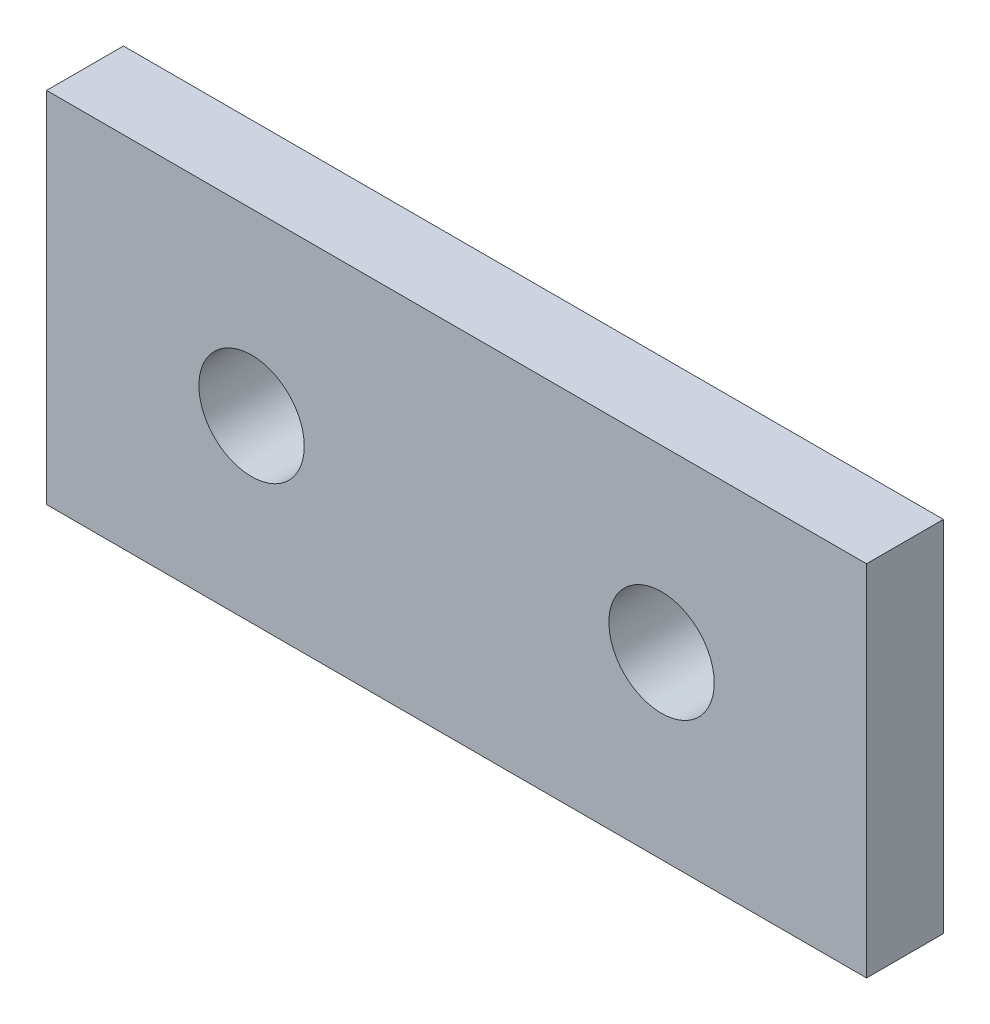
ISO-10303-21;
HEADER;
FILE_DESCRIPTION(('STEP AP214'),'2;1');
FILE_NAME('part.step','',(''),(''),'','','');
FILE_SCHEMA(('AUTOMOTIVE_DESIGN { 1 0 10303 214 1 1 1 1 }'));
ENDSEC;
DATA;
#1=APPLICATION_CONTEXT('core data for automotive mechanical design processes');
#2=APPLICATION_PROTOCOL_DEFINITION('international standard','automotive_design',2000,#1);
#3=PRODUCT_CONTEXT('',#1,'mechanical');
#4=PRODUCT('Part','Part','',(#3));
#5=PRODUCT_RELATED_PRODUCT_CATEGORY('part','',(#4));
#6=PRODUCT_DEFINITION_FORMATION('','',#4);
#7=PRODUCT_DEFINITION_CONTEXT('part definition',#1,'design');
#8=PRODUCT_DEFINITION('design','',#6,#7);
#9=PRODUCT_DEFINITION_SHAPE('','',#8);
#10=(LENGTH_UNIT() NAMED_UNIT(*) SI_UNIT(.MILLI.,.METRE.));
#11=(NAMED_UNIT(*) PLANE_ANGLE_UNIT() SI_UNIT($,.RADIAN.));
#12=(NAMED_UNIT(*) SI_UNIT($,.STERADIAN.) SOLID_ANGLE_UNIT());
#13=UNCERTAINTY_MEASURE_WITH_UNIT(LENGTH_MEASURE(1.E-05),#10,'distance_accuracy_value','');
#14=(GEOMETRIC_REPRESENTATION_CONTEXT(3) GLOBAL_UNCERTAINTY_ASSIGNED_CONTEXT((#13)) GLOBAL_UNIT_ASSIGNED_CONTEXT((#10,
#11,#12)) REPRESENTATION_CONTEXT('',''));
#15=CARTESIAN_POINT('',(0.,0.,0.));
#16=DIRECTION('',(0.,0.,1.));
#17=DIRECTION('',(1.,0.,0.));
#18=AXIS2_PLACEMENT_3D('',#15,#16,#17);
#19=CARTESIAN_POINT('',(-25.4,11.1125,-4.7625));
#20=DIRECTION('',(-1.,0.,0.));
#21=DIRECTION('',(0.,0.,1.));
#22=AXIS2_PLACEMENT_3D('',#19,#20,#21);
#23=PLANE('',#22);
#24=DIRECTION('',(0.,-1.,0.));
#25=VECTOR('',#24,1.);
#26=CARTESIAN_POINT('',(-25.4,11.1125,0.));
#27=LINE('',#26,#25);
#28=CARTESIAN_POINT('',(-25.4,11.1125,0.));
#29=VERTEX_POINT('',#28);
#30=CARTESIAN_POINT('',(-25.4,-11.1125,0.));
#31=VERTEX_POINT('',#30);
#32=EDGE_CURVE('E96',#29,#31,#27,.T.);
#33=ORIENTED_EDGE('',*,*,#32,.F.);
#34=DIRECTION('',(0.,0.,1.));
#35=VECTOR('',#34,1.);
#36=CARTESIAN_POINT('',(-25.4,11.1125,-4.7625));
#37=LINE('',#36,#35);
#38=CARTESIAN_POINT('',(-25.4,11.1125,-4.7625));
#39=VERTEX_POINT('',#38);
#40=EDGE_CURVE('E11',#39,#29,#37,.T.);
#41=ORIENTED_EDGE('',*,*,#40,.F.);
#42=DIRECTION('',(0.,-1.,0.));
#43=VECTOR('',#42,1.);
#44=CARTESIAN_POINT('',(-25.4,11.1125,-4.7625));
#45=LINE('',#44,#43);
#46=CARTESIAN_POINT('',(-25.4,-11.1125,-4.7625));
#47=VERTEX_POINT('',#46);
#48=EDGE_CURVE('E89',#39,#47,#45,.T.);
#49=ORIENTED_EDGE('',*,*,#48,.T.);
#50=DIRECTION('',(0.,0.,1.));
#51=VECTOR('',#50,1.);
#52=CARTESIAN_POINT('',(-25.4,-11.1125,-4.7625));
#53=LINE('',#52,#51);
#54=EDGE_CURVE('E34',#47,#31,#53,.T.);
#55=ORIENTED_EDGE('',*,*,#54,.T.);
#56=EDGE_LOOP('',(#33,#41,#49,#55));
#57=FACE_BOUND('',#56,.T.);
#58=ADVANCED_FACE('F31',(#57),#23,.T.);
#59=CARTESIAN_POINT('',(-25.4,11.1125,-4.7625));
#60=DIRECTION('',(0.,1.,0.));
#61=DIRECTION('',(-1.,0.,0.));
#62=AXIS2_PLACEMENT_3D('',#59,#60,#61);
#63=PLANE('',#62);
#64=DIRECTION('',(-1.,0.,0.));
#65=VECTOR('',#64,1.);
#66=CARTESIAN_POINT('',(-25.4,11.1125,0.));
#67=LINE('',#66,#65);
#68=CARTESIAN_POINT('',(25.4,11.1125,0.));
#69=VERTEX_POINT('',#68);
#70=EDGE_CURVE('E91',#69,#29,#67,.T.);
#71=ORIENTED_EDGE('',*,*,#70,.F.);
#72=DIRECTION('',(0.,0.,1.));
#73=VECTOR('',#72,1.);
#74=CARTESIAN_POINT('',(25.4,11.1125,-4.7625));
#75=LINE('',#74,#73);
#76=CARTESIAN_POINT('',(25.4,11.1125,-4.7625));
#77=VERTEX_POINT('',#76);
#78=EDGE_CURVE('E40',#77,#69,#75,.T.);
#79=ORIENTED_EDGE('',*,*,#78,.F.);
#80=DIRECTION('',(-1.,0.,0.));
#81=VECTOR('',#80,1.);
#82=CARTESIAN_POINT('',(-25.4,11.1125,-4.7625));
#83=LINE('',#82,#81);
#84=EDGE_CURVE('E86',#77,#39,#83,.T.);
#85=ORIENTED_EDGE('',*,*,#84,.T.);
#86=ORIENTED_EDGE('',*,*,#40,.T.);
#87=EDGE_LOOP('',(#71,#79,#85,#86));
#88=FACE_BOUND('',#87,.T.);
#89=ADVANCED_FACE('F107',(#88),#63,.T.);
#90=CARTESIAN_POINT('',(25.4,11.1125,-4.7625));
#91=DIRECTION('',(1.,0.,0.));
#92=DIRECTION('',(0.,0.,-1.));
#93=AXIS2_PLACEMENT_3D('',#90,#91,#92);
#94=PLANE('',#93);
#95=DIRECTION('',(0.,1.,0.));
#96=VECTOR('',#95,1.);
#97=CARTESIAN_POINT('',(25.4,11.1125,0.));
#98=LINE('',#97,#96);
#99=CARTESIAN_POINT('',(25.4,-11.1125,0.));
#100=VERTEX_POINT('',#99);
#101=EDGE_CURVE('E81',#100,#69,#98,.T.);
#102=ORIENTED_EDGE('',*,*,#101,.F.);
#103=DIRECTION('',(0.,0.,1.));
#104=VECTOR('',#103,1.);
#105=CARTESIAN_POINT('',(25.4,-11.1125,-4.7625));
#106=LINE('',#105,#104);
#107=CARTESIAN_POINT('',(25.4,-11.1125,-4.7625));
#108=VERTEX_POINT('',#107);
#109=EDGE_CURVE('E76',#108,#100,#106,.T.);
#110=ORIENTED_EDGE('',*,*,#109,.F.);
#111=DIRECTION('',(0.,1.,0.));
#112=VECTOR('',#111,1.);
#113=CARTESIAN_POINT('',(25.4,11.1125,-4.7625));
#114=LINE('',#113,#112);
#115=EDGE_CURVE('E79',#108,#77,#114,.T.);
#116=ORIENTED_EDGE('',*,*,#115,.T.);
#117=ORIENTED_EDGE('',*,*,#78,.T.);
#118=EDGE_LOOP('',(#102,#110,#116,#117));
#119=FACE_BOUND('',#118,.T.);
#120=ADVANCED_FACE('F78',(#119),#94,.T.);
#121=CARTESIAN_POINT('',(-25.4,-11.1125,-4.7625));
#122=DIRECTION('',(0.,-1.,0.));
#123=DIRECTION('',(1.,0.,0.));
#124=AXIS2_PLACEMENT_3D('',#121,#122,#123);
#125=PLANE('',#124);
#126=DIRECTION('',(1.,0.,0.));
#127=VECTOR('',#126,1.);
#128=CARTESIAN_POINT('',(-25.4,-11.1125,0.));
#129=LINE('',#128,#127);
#130=EDGE_CURVE('E99',#31,#100,#129,.T.);
#131=ORIENTED_EDGE('',*,*,#130,.F.);
#132=ORIENTED_EDGE('',*,*,#54,.F.);
#133=DIRECTION('',(1.,0.,0.));
#134=VECTOR('',#133,1.);
#135=CARTESIAN_POINT('',(-25.4,-11.1125,-4.7625));
#136=LINE('',#135,#134);
#137=EDGE_CURVE('E85',#47,#108,#136,.T.);
#138=ORIENTED_EDGE('',*,*,#137,.T.);
#139=ORIENTED_EDGE('',*,*,#109,.T.);
#140=EDGE_LOOP('',(#131,#132,#138,#139));
#141=FACE_BOUND('',#140,.T.);
#142=ADVANCED_FACE('F88',(#141),#125,.T.);
#143=CARTESIAN_POINT('',(-25.4,-11.1125,-4.7625));
#144=DIRECTION('',(0.,0.,1.));
#145=DIRECTION('',(1.,0.,0.));
#146=AXIS2_PLACEMENT_3D('',#143,#144,#145);
#147=PLANE('',#146);
#148=CARTESIAN_POINT('',(-12.7,0.,-4.7625));
#149=DIRECTION('',(0.,0.,1.));
#150=DIRECTION('',(1.,0.,0.));
#151=AXIS2_PLACEMENT_3D('',#148,#149,#150);
#152=CIRCLE('',#151,3.2639);
#153=CARTESIAN_POINT('',(-9.43610000000001,0.,-4.7625));
#154=VERTEX_POINT('',#153);
#155=EDGE_CURVE('E140',#154,#154,#152,.T.);
#156=ORIENTED_EDGE('',*,*,#155,.T.);
#157=EDGE_LOOP('',(#156));
#158=FACE_BOUND('',#157,.T.);
#159=CARTESIAN_POINT('',(12.7,0.,-4.7625));
#160=DIRECTION('',(0.,0.,1.));
#161=DIRECTION('',(1.,0.,0.));
#162=AXIS2_PLACEMENT_3D('',#159,#160,#161);
#163=CIRCLE('',#162,3.2639);
#164=CARTESIAN_POINT('',(15.9639,0.,-4.7625));
#165=VERTEX_POINT('',#164);
#166=EDGE_CURVE('E100',#165,#165,#163,.T.);
#167=ORIENTED_EDGE('',*,*,#166,.T.);
#168=EDGE_LOOP('',(#167));
#169=FACE_BOUND('',#168,.T.);
#170=ORIENTED_EDGE('',*,*,#48,.F.);
#171=ORIENTED_EDGE('',*,*,#84,.F.);
#172=ORIENTED_EDGE('',*,*,#115,.F.);
#173=ORIENTED_EDGE('',*,*,#137,.F.);
#174=EDGE_LOOP('',(#170,#171,#172,#173));
#175=FACE_BOUND('',#174,.T.);
#176=ADVANCED_FACE('F84',(#158,#169,#175),#147,.F.);
#177=CARTESIAN_POINT('',(-25.4,-11.1125,0.));
#178=DIRECTION('',(0.,0.,1.));
#179=DIRECTION('',(1.,0.,0.));
#180=AXIS2_PLACEMENT_3D('',#177,#178,#179);
#181=PLANE('',#180);
#182=CARTESIAN_POINT('',(-12.7,0.,0.));
#183=DIRECTION('',(0.,0.,1.));
#184=DIRECTION('',(1.,0.,0.));
#185=AXIS2_PLACEMENT_3D('',#182,#183,#184);
#186=CIRCLE('',#185,3.2639);
#187=CARTESIAN_POINT('',(-9.43610000000001,0.,0.));
#188=VERTEX_POINT('',#187);
#189=EDGE_CURVE('E143',#188,#188,#186,.T.);
#190=ORIENTED_EDGE('',*,*,#189,.F.);
#191=EDGE_LOOP('',(#190));
#192=FACE_BOUND('',#191,.T.);
#193=CARTESIAN_POINT('',(12.7,0.,0.));
#194=DIRECTION('',(0.,0.,1.));
#195=DIRECTION('',(1.,0.,0.));
#196=AXIS2_PLACEMENT_3D('',#193,#194,#195);
#197=CIRCLE('',#196,3.2639);
#198=CARTESIAN_POINT('',(15.9639,0.,0.));
#199=VERTEX_POINT('',#198);
#200=EDGE_CURVE('E145',#199,#199,#197,.T.);
#201=ORIENTED_EDGE('',*,*,#200,.F.);
#202=EDGE_LOOP('',(#201));
#203=FACE_BOUND('',#202,.T.);
#204=ORIENTED_EDGE('',*,*,#32,.T.);
#205=ORIENTED_EDGE('',*,*,#130,.T.);
#206=ORIENTED_EDGE('',*,*,#101,.T.);
#207=ORIENTED_EDGE('',*,*,#70,.T.);
#208=EDGE_LOOP('',(#204,#205,#206,#207));
#209=FACE_BOUND('',#208,.T.);
#210=ADVANCED_FACE('F106',(#192,#203,#209),#181,.T.);
#211=CARTESIAN_POINT('',(12.7,0.,-4.7625));
#212=DIRECTION('',(0.,0.,1.));
#213=DIRECTION('',(1.,0.,0.));
#214=AXIS2_PLACEMENT_3D('',#211,#212,#213);
#215=CYLINDRICAL_SURFACE('',#214,3.2639);
#216=ORIENTED_EDGE('',*,*,#166,.F.);
#217=EDGE_LOOP('',(#216));
#218=FACE_BOUND('',#217,.T.);
#219=ORIENTED_EDGE('',*,*,#200,.T.);
#220=EDGE_LOOP('',(#219));
#221=FACE_BOUND('',#220,.T.);
#222=ADVANCED_FACE('F125',(#218,#221),#215,.F.);
#223=CARTESIAN_POINT('',(-12.7,0.,-4.7625));
#224=DIRECTION('',(0.,0.,1.));
#225=DIRECTION('',(1.,0.,0.));
#226=AXIS2_PLACEMENT_3D('',#223,#224,#225);
#227=CYLINDRICAL_SURFACE('',#226,3.2639);
#228=ORIENTED_EDGE('',*,*,#155,.F.);
#229=EDGE_LOOP('',(#228));
#230=FACE_BOUND('',#229,.T.);
#231=ORIENTED_EDGE('',*,*,#189,.T.);
#232=EDGE_LOOP('',(#231));
#233=FACE_BOUND('',#232,.T.);
#234=ADVANCED_FACE('F132',(#230,#233),#227,.F.);
#235=CLOSED_SHELL('',(#58,#89,#120,#142,#176,#210,#222,#234));
#236=MANIFOLD_SOLID_BREP('B2',#235);
#237=ADVANCED_BREP_SHAPE_REPRESENTATION('',(#18,#236),#14);
#238=SHAPE_DEFINITION_REPRESENTATION(#9,#237);
ENDSEC;
END-ISO-10303-21;
